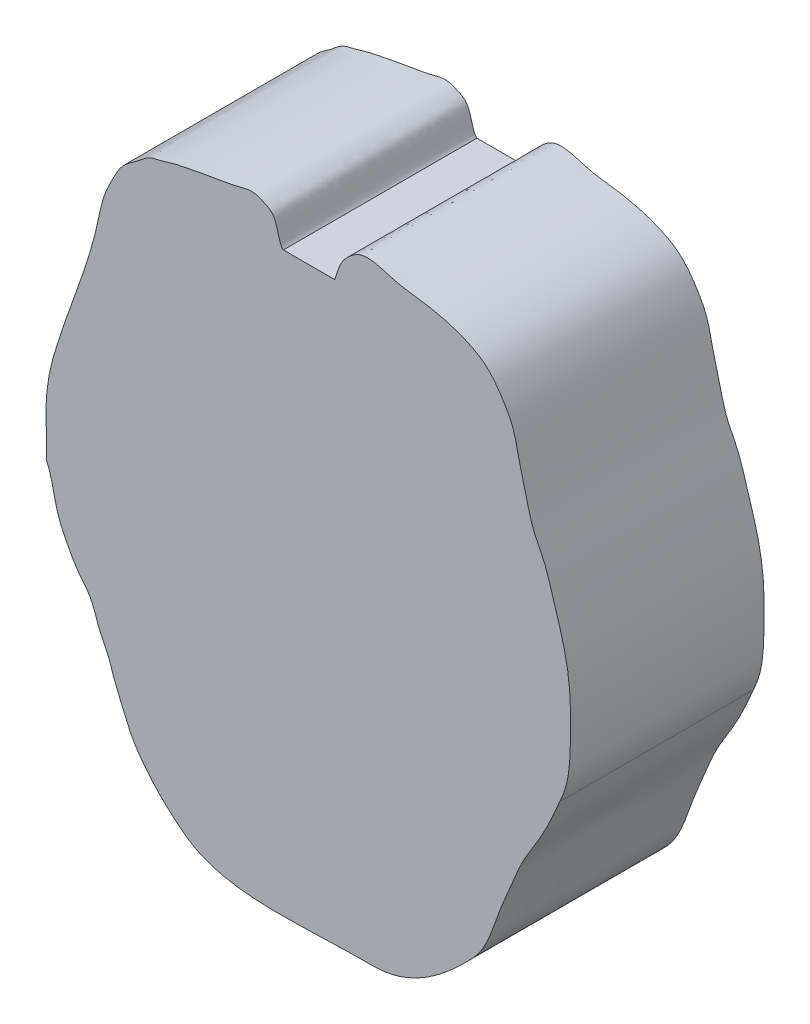
ISO-10303-21;
HEADER;
FILE_DESCRIPTION(('STEP AP214'),'2;1');
FILE_NAME('part.step','',(''),(''),'','','');
FILE_SCHEMA(('AUTOMOTIVE_DESIGN { 1 0 10303 214 1 1 1 1 }'));
ENDSEC;
DATA;
#1=APPLICATION_CONTEXT('core data for automotive mechanical design processes');
#2=APPLICATION_PROTOCOL_DEFINITION('international standard','automotive_design',2000,#1);
#3=PRODUCT_CONTEXT('',#1,'mechanical');
#4=PRODUCT('Part','Part','',(#3));
#5=PRODUCT_RELATED_PRODUCT_CATEGORY('part','',(#4));
#6=PRODUCT_DEFINITION_FORMATION('','',#4);
#7=PRODUCT_DEFINITION_CONTEXT('part definition',#1,'design');
#8=PRODUCT_DEFINITION('design','',#6,#7);
#9=PRODUCT_DEFINITION_SHAPE('','',#8);
#10=(LENGTH_UNIT() NAMED_UNIT(*) SI_UNIT(.MILLI.,.METRE.));
#11=(NAMED_UNIT(*) PLANE_ANGLE_UNIT() SI_UNIT($,.RADIAN.));
#12=(NAMED_UNIT(*) SI_UNIT($,.STERADIAN.) SOLID_ANGLE_UNIT());
#13=UNCERTAINTY_MEASURE_WITH_UNIT(LENGTH_MEASURE(1.E-05),#10,'distance_accuracy_value','');
#14=(GEOMETRIC_REPRESENTATION_CONTEXT(3) GLOBAL_UNCERTAINTY_ASSIGNED_CONTEXT((#13)) GLOBAL_UNIT_ASSIGNED_CONTEXT((#10,
#11,#12)) REPRESENTATION_CONTEXT('',''));
#15=CARTESIAN_POINT('',(0.,0.,0.));
#16=DIRECTION('',(0.,0.,1.));
#17=DIRECTION('',(1.,0.,0.));
#18=AXIS2_PLACEMENT_3D('',#15,#16,#17);
#19=CARTESIAN_POINT('',(6.72674796262277,70.641339760184,39.9268166449645));
#20=DIRECTION('',(0.,-1.,0.));
#21=DIRECTION('',(0.,0.,-1.));
#22=AXIS2_PLACEMENT_3D('',#19,#20,#21);
#23=PLANE('',#22);
#24=CARTESIAN_POINT('',(6.72674796262277,70.641339760184,0.));
#25=CARTESIAN_POINT('',(-3.87263552604294,70.641339760184,0.));
#26=B_SPLINE_CURVE_WITH_KNOTS('',1,(#24,#25),.UNSPECIFIED.,.F.,.F.,(2,2),(0.,1.),.UNSPECIFIED.);
#27=CARTESIAN_POINT('',(6.72674796262277,70.641339760184,0.));
#28=VERTEX_POINT('',#27);
#29=CARTESIAN_POINT('',(-3.87263552604294,70.641339760184,0.));
#30=VERTEX_POINT('',#29);
#31=EDGE_CURVE('E193',#28,#30,#26,.T.);
#32=ORIENTED_EDGE('',*,*,#31,.T.);
#33=DIRECTION('',(0.,0.,-1.));
#34=VECTOR('',#33,1.);
#35=CARTESIAN_POINT('',(-3.87263552604294,70.641339760184,39.9268166449645));
#36=LINE('',#35,#34);
#37=CARTESIAN_POINT('',(-3.87263552604294,70.641339760184,39.9268166449645));
#38=VERTEX_POINT('',#37);
#39=EDGE_CURVE('E11',#38,#30,#36,.T.);
#40=ORIENTED_EDGE('',*,*,#39,.F.);
#41=CARTESIAN_POINT('',(6.72674796262277,70.641339760184,39.9268166449645));
#42=CARTESIAN_POINT('',(-3.87263552604294,70.641339760184,39.9268166449645));
#43=B_SPLINE_CURVE_WITH_KNOTS('',1,(#41,#42),.UNSPECIFIED.,.F.,.F.,(2,2),(0.,1.),.UNSPECIFIED.);
#44=CARTESIAN_POINT('',(6.72674796262277,70.641339760184,39.9268166449645));
#45=VERTEX_POINT('',#44);
#46=EDGE_CURVE('E170',#45,#38,#43,.T.);
#47=ORIENTED_EDGE('',*,*,#46,.F.);
#48=DIRECTION('',(0.,0.,-1.));
#49=VECTOR('',#48,1.);
#50=CARTESIAN_POINT('',(6.72674796262277,70.641339760184,39.9268166449645));
#51=LINE('',#50,#49);
#52=EDGE_CURVE('E122',#45,#28,#51,.T.);
#53=ORIENTED_EDGE('',*,*,#52,.T.);
#54=EDGE_LOOP('',(#32,#40,#47,#53));
#55=FACE_BOUND('',#54,.T.);
#56=ADVANCED_FACE('F36',(#55),#23,.F.);
#57=CARTESIAN_POINT('',(-3.87263552604294,70.641339760184,39.9268166449645));
#58=CARTESIAN_POINT('',(-5.09944013174748,71.7202582335475,39.9268166449645));
#59=CARTESIAN_POINT('',(-4.8391645012602,75.6991577322834,39.9268166449645));
#60=CARTESIAN_POINT('',(-7.87878213783911,77.1347364284955,39.9268166449645));
#61=CARTESIAN_POINT('',(-9.47084895305679,77.8670577057418,39.9268166449645));
#62=CARTESIAN_POINT('',(-11.4452976249097,77.8144196798321,39.9268166449645));
#63=CARTESIAN_POINT('',(-13.5078827629788,77.1487603992426,39.9268166449645));
#64=CARTESIAN_POINT('',(-15.9803315749228,76.7605352808646,39.9268166449645));
#65=CARTESIAN_POINT('',(-18.6691196158922,76.2603937797415,39.9268166449645));
#66=CARTESIAN_POINT('',(-21.3352211577586,75.8237386927429,39.9268166449645));
#67=CARTESIAN_POINT('',(-24.149306579347,75.2221812203888,39.9268166449645));
#68=CARTESIAN_POINT('',(-26.661349391268,74.7820095672842,39.9268166449645));
#69=CARTESIAN_POINT('',(-29.0819249946789,73.8707714908555,39.9268166449645));
#70=CARTESIAN_POINT('',(-31.6663585343292,73.5617510529868,39.9268166449645));
#71=CARTESIAN_POINT('',(-33.9722235392609,71.2892773254946,39.9268166449645));
#72=CARTESIAN_POINT('',(-37.0148975065258,69.5576384801271,39.9268166449645));
#73=CARTESIAN_POINT('',(-39.1304080875687,65.759515520526,39.9268166449645));
#74=CARTESIAN_POINT('',(-41.2080549192268,61.5479524877048,39.9268166449645));
#75=CARTESIAN_POINT('',(-43.3269524566974,49.3288113552713,39.9268166449645));
#76=CARTESIAN_POINT('',(-47.62014341395,39.6563976296241,39.9268166449645));
#77=CARTESIAN_POINT('',(-50.2720091525815,31.2148099085499,39.9268166449645));
#78=B_SPLINE_CURVE_WITH_KNOTS('',3,(#57,#58,#59,#60,#61,#62,#63,#64,#65,#66,#67,#68,#69,#70,#71,
#72,#73,#74,#75,#76,#77),.UNSPECIFIED.,.F.,.F.,(4,1,1,1,1,1,1,1,1,1,1,1,1,1,1,1,1,1,4),(0.,
0.0774511265590292,0.0982020040132911,0.123194437276303,0.143123415569983,0.170918111330584,
0.20497811919955,0.237509029996539,0.274369119849238,0.307032128522416,0.346404150243918,
0.370266332496988,0.404974599356961,0.44113398183362,0.4888264911591,0.535018961012619,
0.60128812689905,0.666373303021425,1.),.UNSPECIFIED.);
#79=DIRECTION('',(0.,0.,-1.));
#80=VECTOR('',#79,1.);
#81=SURFACE_OF_LINEAR_EXTRUSION('',#78,#80);
#82=CARTESIAN_POINT('',(-3.87263552604294,70.641339760184,0.));
#83=CARTESIAN_POINT('',(-5.09944013174748,71.7202582335475,0.));
#84=CARTESIAN_POINT('',(-4.8391645012602,75.6991577322834,0.));
#85=CARTESIAN_POINT('',(-7.87878213783911,77.1347364284955,0.));
#86=CARTESIAN_POINT('',(-9.47084895305679,77.8670577057418,0.));
#87=CARTESIAN_POINT('',(-11.4452976249097,77.8144196798321,0.));
#88=CARTESIAN_POINT('',(-13.5078827629788,77.1487603992426,0.));
#89=CARTESIAN_POINT('',(-15.9803315749228,76.7605352808646,0.));
#90=CARTESIAN_POINT('',(-18.6691196158922,76.2603937797415,0.));
#91=CARTESIAN_POINT('',(-21.3352211577586,75.8237386927429,0.));
#92=CARTESIAN_POINT('',(-24.149306579347,75.2221812203888,0.));
#93=CARTESIAN_POINT('',(-26.661349391268,74.7820095672842,0.));
#94=CARTESIAN_POINT('',(-29.0819249946789,73.8707714908555,0.));
#95=CARTESIAN_POINT('',(-31.6663585343292,73.5617510529868,0.));
#96=CARTESIAN_POINT('',(-33.9722235392609,71.2892773254946,0.));
#97=CARTESIAN_POINT('',(-37.0148975065258,69.5576384801271,0.));
#98=CARTESIAN_POINT('',(-39.1304080875687,65.759515520526,0.));
#99=CARTESIAN_POINT('',(-41.2080549192268,61.5479524877048,0.));
#100=CARTESIAN_POINT('',(-43.3269524566974,49.3288113552713,0.));
#101=CARTESIAN_POINT('',(-47.62014341395,39.6563976296241,0.));
#102=CARTESIAN_POINT('',(-50.2720091525815,31.2148099085499,0.));
#103=B_SPLINE_CURVE_WITH_KNOTS('',3,(#82,#83,#84,#85,#86,#87,#88,#89,#90,#91,#92,#93,#94,#95,
#96,#97,#98,#99,#100,#101,#102),.UNSPECIFIED.,.F.,.F.,(4,1,1,1,1,1,1,1,1,1,1,1,1,1,1,1,1,1,4),
(0.,0.0774511265590292,0.0982020040132911,0.123194437276303,0.143123415569983,0.170918111330584,
0.20497811919955,0.237509029996539,0.274369119849238,0.307032128522416,0.346404150243918,
0.370266332496988,0.404974599356961,0.44113398183362,0.4888264911591,0.535018961012619,
0.60128812689905,0.666373303021425,1.),.UNSPECIFIED.);
#104=CARTESIAN_POINT('',(-50.2720091525815,31.2148099085499,0.));
#105=VERTEX_POINT('',#104);
#106=EDGE_CURVE('E184',#30,#105,#103,.T.);
#107=ORIENTED_EDGE('',*,*,#106,.T.);
#108=DIRECTION('',(0.,0.,-1.));
#109=VECTOR('',#108,1.);
#110=CARTESIAN_POINT('',(-50.2720091525815,31.2148099085499,39.9268166449645));
#111=LINE('',#110,#109);
#112=CARTESIAN_POINT('',(-50.2720091525815,31.2148099085499,39.9268166449645));
#113=VERTEX_POINT('',#112);
#114=EDGE_CURVE('E44',#113,#105,#111,.T.);
#115=ORIENTED_EDGE('',*,*,#114,.F.);
#116=EDGE_CURVE('E92',#38,#113,#78,.T.);
#117=ORIENTED_EDGE('',*,*,#116,.F.);
#118=ORIENTED_EDGE('',*,*,#39,.T.);
#119=EDGE_LOOP('',(#107,#115,#117,#118));
#120=FACE_BOUND('',#119,.T.);
#121=ADVANCED_FACE('F176',(#120),#81,.F.);
#122=CARTESIAN_POINT('',(-50.2720091525815,31.2148099085499,39.9268166449645));
#123=CARTESIAN_POINT('',(-51.5763422772298,27.3932307870519,39.9268166449645));
#124=CARTESIAN_POINT('',(-53.4233428912386,19.9068336489793,39.9268166449645));
#125=CARTESIAN_POINT('',(-52.5875733557582,12.3046540251995,39.9268166449645));
#126=CARTESIAN_POINT('',(-52.7861792261766,8.80812641619491,39.9268166449645));
#127=B_SPLINE_CURVE_WITH_KNOTS('',3,(#122,#123,#124,#125,#126),.UNSPECIFIED.,.F.,.F.,(4,1,4),
(0.,0.536736953329797,1.),.UNSPECIFIED.);
#128=DIRECTION('',(0.,0.,-1.));
#129=VECTOR('',#128,1.);
#130=SURFACE_OF_LINEAR_EXTRUSION('',#127,#129);
#131=CARTESIAN_POINT('',(-50.2720091525815,31.2148099085499,0.));
#132=CARTESIAN_POINT('',(-51.5763422772298,27.3932307870519,0.));
#133=CARTESIAN_POINT('',(-53.4233428912386,19.9068336489793,0.));
#134=CARTESIAN_POINT('',(-52.5875733557582,12.3046540251995,0.));
#135=CARTESIAN_POINT('',(-52.7861792261766,8.80812641619491,0.));
#136=B_SPLINE_CURVE_WITH_KNOTS('',3,(#131,#132,#133,#134,#135),.UNSPECIFIED.,.F.,.F.,(4,1,4),
(0.,0.536736953329797,1.),.UNSPECIFIED.);
#137=CARTESIAN_POINT('',(-52.7861792261766,8.80812641619491,0.));
#138=VERTEX_POINT('',#137);
#139=EDGE_CURVE('E192',#105,#138,#136,.T.);
#140=ORIENTED_EDGE('',*,*,#139,.T.);
#141=DIRECTION('',(0.,0.,-1.));
#142=VECTOR('',#141,1.);
#143=CARTESIAN_POINT('',(-52.7861792261766,8.80812641619491,39.9268166449645));
#144=LINE('',#143,#142);
#145=CARTESIAN_POINT('',(-52.7861792261766,8.80812641619491,39.9268166449645));
#146=VERTEX_POINT('',#145);
#147=EDGE_CURVE('E197',#146,#138,#144,.T.);
#148=ORIENTED_EDGE('',*,*,#147,.F.);
#149=EDGE_CURVE('E155',#113,#146,#127,.T.);
#150=ORIENTED_EDGE('',*,*,#149,.F.);
#151=ORIENTED_EDGE('',*,*,#114,.T.);
#152=EDGE_LOOP('',(#140,#148,#150,#151));
#153=FACE_BOUND('',#152,.T.);
#154=ADVANCED_FACE('F149',(#153),#130,.F.);
#155=CARTESIAN_POINT('',(-52.7861792261766,8.80812641619491,39.9268166449645));
#156=CARTESIAN_POINT('',(-51.4865977191283,5.9961133371352,39.9268166449645));
#157=CARTESIAN_POINT('',(-51.1363292863908,1.16422141057562,39.9268166449645));
#158=CARTESIAN_POINT('',(-48.4418175728673,-4.23458441890672,39.9268166449645));
#159=CARTESIAN_POINT('',(-46.2897119246832,-8.18480071899676,39.9268166449645));
#160=CARTESIAN_POINT('',(-43.5029832785752,-10.9590209191812,39.9268166449645));
#161=CARTESIAN_POINT('',(-41.733594112655,-16.6364645360096,39.9268166449645));
#162=CARTESIAN_POINT('',(-41.9507270533705,-15.7973502986241,39.9268166449645));
#163=CARTESIAN_POINT('',(-39.9034124539514,-20.1028890960595,39.9268166449645));
#164=B_SPLINE_CURVE_WITH_KNOTS('',3,(#155,#156,#157,#158,#159,#160,#161,#162,#163),
.UNSPECIFIED.,.F.,.F.,(4,1,1,1,1,1,4),(0.,0.289905529763368,0.441015591769616,0.567124192582072,
0.705030422219852,0.830943547768982,1.),.UNSPECIFIED.);
#165=DIRECTION('',(0.,0.,-1.));
#166=VECTOR('',#165,1.);
#167=SURFACE_OF_LINEAR_EXTRUSION('',#164,#166);
#168=CARTESIAN_POINT('',(-52.7861792261766,8.80812641619491,0.));
#169=CARTESIAN_POINT('',(-51.4865977191283,5.9961133371352,0.));
#170=CARTESIAN_POINT('',(-51.1363292863908,1.16422141057562,0.));
#171=CARTESIAN_POINT('',(-48.4418175728673,-4.23458441890672,0.));
#172=CARTESIAN_POINT('',(-46.2897119246832,-8.18480071899676,0.));
#173=CARTESIAN_POINT('',(-43.5029832785752,-10.9590209191812,0.));
#174=CARTESIAN_POINT('',(-41.733594112655,-16.6364645360096,0.));
#175=CARTESIAN_POINT('',(-41.9507270533705,-15.7973502986241,0.));
#176=CARTESIAN_POINT('',(-39.9034124539514,-20.1028890960595,0.));
#177=B_SPLINE_CURVE_WITH_KNOTS('',3,(#168,#169,#170,#171,#172,#173,#174,#175,#176),
.UNSPECIFIED.,.F.,.F.,(4,1,1,1,1,1,4),(0.,0.289905529763368,0.441015591769616,0.567124192582072,
0.705030422219852,0.830943547768982,1.),.UNSPECIFIED.);
#178=CARTESIAN_POINT('',(-39.9034124539514,-20.1028890960595,0.));
#179=VERTEX_POINT('',#178);
#180=EDGE_CURVE('E200',#138,#179,#177,.T.);
#181=ORIENTED_EDGE('',*,*,#180,.T.);
#182=DIRECTION('',(0.,0.,-1.));
#183=VECTOR('',#182,1.);
#184=CARTESIAN_POINT('',(-39.9034124539514,-20.1028890960595,39.9268166449645));
#185=LINE('',#184,#183);
#186=CARTESIAN_POINT('',(-39.9034124539514,-20.1028890960595,39.9268166449645));
#187=VERTEX_POINT('',#186);
#188=EDGE_CURVE('E117',#187,#179,#185,.T.);
#189=ORIENTED_EDGE('',*,*,#188,.F.);
#190=EDGE_CURVE('E108',#146,#187,#164,.T.);
#191=ORIENTED_EDGE('',*,*,#190,.F.);
#192=ORIENTED_EDGE('',*,*,#147,.T.);
#193=EDGE_LOOP('',(#181,#189,#191,#192));
#194=FACE_BOUND('',#193,.T.);
#195=ADVANCED_FACE('F146',(#194),#167,.F.);
#196=CARTESIAN_POINT('',(-39.9034124539515,-20.1028890960593,39.9268166449645));
#197=CARTESIAN_POINT('',(-39.0998291556524,-22.9104169298894,39.9268166449645));
#198=CARTESIAN_POINT('',(-37.3442060578139,-26.9250580714331,39.9268166449645));
#199=CARTESIAN_POINT('',(-35.2237735228893,-32.003363894348,39.9268166449645));
#200=CARTESIAN_POINT('',(-33.1858212067055,-35.0112691852337,39.9268166449645));
#201=CARTESIAN_POINT('',(-30.4295574621468,-38.4946348106708,39.9268166449645));
#202=CARTESIAN_POINT('',(-26.8550213189226,-41.9158690350379,39.9268166449645));
#203=CARTESIAN_POINT('',(-22.3074948875386,-45.4830447818576,39.9268166449645));
#204=CARTESIAN_POINT('',(-16.9530110988268,-47.4294339779559,39.9268166449645));
#205=CARTESIAN_POINT('',(-8.01464693299461,-48.6813412335191,39.9268166449645));
#206=CARTESIAN_POINT('',(1.87109432689435,-48.2180111393805,39.9268166449645));
#207=CARTESIAN_POINT('',(11.212196278673,-48.0110144165786,39.9268166449645));
#208=CARTESIAN_POINT('',(17.900915079522,-48.0643041684941,39.9268166449645));
#209=CARTESIAN_POINT('',(26.5333796790699,-44.8844617482461,39.9268166449645));
#210=CARTESIAN_POINT('',(31.9368966027794,-39.7225221159024,39.9268166449645));
#211=CARTESIAN_POINT('',(35.4121876941389,-36.0981901094731,39.9268166449645));
#212=B_SPLINE_CURVE_WITH_KNOTS('',3,(#196,#197,#198,#199,#200,#201,#202,#203,#204,#205,#206,
#207,#208,#209,#210,#211),.UNSPECIFIED.,.F.,.F.,(4,1,1,1,1,1,1,1,1,1,1,1,1,4),(0.,
0.0934032550822364,0.141289000741847,0.176289094702898,0.209818558322268,0.284015881068497,
0.334991321928554,0.394353771340265,0.46445241004427,0.624297851181017,0.711020843592571,
0.765725627006861,0.837948314396401,1.),.UNSPECIFIED.);
#213=DIRECTION('',(0.,0.,-1.));
#214=VECTOR('',#213,1.);
#215=SURFACE_OF_LINEAR_EXTRUSION('',#212,#214);
#216=CARTESIAN_POINT('',(-39.9034124539515,-20.1028890960593,0.));
#217=CARTESIAN_POINT('',(-39.0998291556524,-22.9104169298894,0.));
#218=CARTESIAN_POINT('',(-37.3442060578139,-26.9250580714331,0.));
#219=CARTESIAN_POINT('',(-35.2237735228893,-32.003363894348,0.));
#220=CARTESIAN_POINT('',(-33.1858212067055,-35.0112691852337,0.));
#221=CARTESIAN_POINT('',(-30.4295574621468,-38.4946348106708,0.));
#222=CARTESIAN_POINT('',(-26.8550213189226,-41.9158690350379,0.));
#223=CARTESIAN_POINT('',(-22.3074948875386,-45.4830447818576,0.));
#224=CARTESIAN_POINT('',(-16.9530110988268,-47.4294339779559,0.));
#225=CARTESIAN_POINT('',(-8.01464693299461,-48.6813412335191,0.));
#226=CARTESIAN_POINT('',(1.87109432689435,-48.2180111393805,0.));
#227=CARTESIAN_POINT('',(11.212196278673,-48.0110144165786,0.));
#228=CARTESIAN_POINT('',(17.900915079522,-48.0643041684941,0.));
#229=CARTESIAN_POINT('',(26.5333796790699,-44.8844617482461,0.));
#230=CARTESIAN_POINT('',(31.9368966027794,-39.7225221159024,0.));
#231=CARTESIAN_POINT('',(35.4121876941389,-36.0981901094731,0.));
#232=B_SPLINE_CURVE_WITH_KNOTS('',3,(#216,#217,#218,#219,#220,#221,#222,#223,#224,#225,#226,
#227,#228,#229,#230,#231),.UNSPECIFIED.,.F.,.F.,(4,1,1,1,1,1,1,1,1,1,1,1,1,4),(0.,
0.0934032550822364,0.141289000741847,0.176289094702898,0.209818558322268,0.284015881068497,
0.334991321928554,0.394353771340265,0.46445241004427,0.624297851181017,0.711020843592571,
0.765725627006861,0.837948314396401,1.),.UNSPECIFIED.);
#233=CARTESIAN_POINT('',(35.4121876941389,-36.0981901094731,0.));
#234=VERTEX_POINT('',#233);
#235=EDGE_CURVE('E116',#179,#234,#232,.T.);
#236=ORIENTED_EDGE('',*,*,#235,.T.);
#237=DIRECTION('',(0.,0.,-1.));
#238=VECTOR('',#237,1.);
#239=CARTESIAN_POINT('',(35.4121876941389,-36.0981901094731,39.9268166449645));
#240=LINE('',#239,#238);
#241=CARTESIAN_POINT('',(35.4121876941389,-36.0981901094731,39.9268166449645));
#242=VERTEX_POINT('',#241);
#243=EDGE_CURVE('E113',#242,#234,#240,.T.);
#244=ORIENTED_EDGE('',*,*,#243,.F.);
#245=EDGE_CURVE('E102',#187,#242,#212,.T.);
#246=ORIENTED_EDGE('',*,*,#245,.F.);
#247=ORIENTED_EDGE('',*,*,#188,.T.);
#248=EDGE_LOOP('',(#236,#244,#246,#247));
#249=FACE_BOUND('',#248,.T.);
#250=ADVANCED_FACE('F114',(#249),#215,.F.);
#251=CARTESIAN_POINT('',(35.4121876941389,-36.0981901094731,39.9268166449645));
#252=CARTESIAN_POINT('',(38.1690914988455,-33.0761228335682,39.9268166449645));
#253=CARTESIAN_POINT('',(39.8238498013174,-26.9315043106738,39.9268166449645));
#254=CARTESIAN_POINT('',(43.0427830611868,-19.5827426456605,39.9268166449645));
#255=CARTESIAN_POINT('',(45.4511896779582,-13.5168832446893,39.9268166449645));
#256=CARTESIAN_POINT('',(49.6140543508931,-7.43634159655043,39.9268166449645));
#257=CARTESIAN_POINT('',(51.9050143659175,-2.34954970833097,39.9268166449645));
#258=CARTESIAN_POINT('',(53.1059664971144,0.539121339267715,39.9268166449645));
#259=B_SPLINE_CURVE_WITH_KNOTS('',3,(#251,#252,#253,#254,#255,#256,#257,#258),.UNSPECIFIED.,.F.,
.F.,(4,1,1,1,1,4),(0.,0.29143047063952,0.461022707010863,0.591081239960475,0.769748109807126,
1.),.UNSPECIFIED.);
#260=DIRECTION('',(0.,0.,-1.));
#261=VECTOR('',#260,1.);
#262=SURFACE_OF_LINEAR_EXTRUSION('',#259,#261);
#263=CARTESIAN_POINT('',(35.4121876941389,-36.0981901094731,0.));
#264=CARTESIAN_POINT('',(38.1690914988455,-33.0761228335682,0.));
#265=CARTESIAN_POINT('',(39.8238498013174,-26.9315043106738,0.));
#266=CARTESIAN_POINT('',(43.0427830611868,-19.5827426456605,0.));
#267=CARTESIAN_POINT('',(45.4511896779582,-13.5168832446893,0.));
#268=CARTESIAN_POINT('',(49.6140543508931,-7.43634159655043,0.));
#269=CARTESIAN_POINT('',(51.9050143659175,-2.34954970833097,0.));
#270=CARTESIAN_POINT('',(53.1059664971144,0.539121339267715,0.));
#271=B_SPLINE_CURVE_WITH_KNOTS('',3,(#263,#264,#265,#266,#267,#268,#269,#270),.UNSPECIFIED.,.F.,
.F.,(4,1,1,1,1,4),(0.,0.29143047063952,0.461022707010863,0.591081239960475,0.769748109807126,
1.),.UNSPECIFIED.);
#272=CARTESIAN_POINT('',(53.1059664971144,0.539121339267715,0.));
#273=VERTEX_POINT('',#272);
#274=EDGE_CURVE('E78',#234,#273,#271,.T.);
#275=ORIENTED_EDGE('',*,*,#274,.T.);
#276=DIRECTION('',(0.,0.,-1.));
#277=VECTOR('',#276,1.);
#278=CARTESIAN_POINT('',(53.1059664971144,0.539121339267715,39.9268166449645));
#279=LINE('',#278,#277);
#280=CARTESIAN_POINT('',(53.1059664971144,0.539121339267715,39.9268166449645));
#281=VERTEX_POINT('',#280);
#282=EDGE_CURVE('E118',#281,#273,#279,.T.);
#283=ORIENTED_EDGE('',*,*,#282,.F.);
#284=EDGE_CURVE('E106',#242,#281,#259,.T.);
#285=ORIENTED_EDGE('',*,*,#284,.F.);
#286=ORIENTED_EDGE('',*,*,#243,.T.);
#287=EDGE_LOOP('',(#275,#283,#285,#286));
#288=FACE_BOUND('',#287,.T.);
#289=ADVANCED_FACE('F120',(#288),#262,.F.);
#290=CARTESIAN_POINT('',(53.1059664971144,0.539121339267715,39.9268166449645));
#291=CARTESIAN_POINT('',(55.2852913333332,4.843146783831,39.9268166449645));
#292=CARTESIAN_POINT('',(55.3300398881401,11.9807710725099,39.9268166449645));
#293=CARTESIAN_POINT('',(55.3797901299483,21.6845381107091,39.9268166449645));
#294=CARTESIAN_POINT('',(54.1242805055026,28.9239693255598,39.9268166449645));
#295=CARTESIAN_POINT('',(51.8256335895225,35.7560464423616,39.9268166449645));
#296=CARTESIAN_POINT('',(50.2568879620993,41.7021116891916,39.9268166449645));
#297=CARTESIAN_POINT('',(47.6076950450311,46.1436055606771,39.9268166449645));
#298=CARTESIAN_POINT('',(46.2378796255596,51.59825324403,39.9268166449645));
#299=CARTESIAN_POINT('',(44.7339743523664,57.1240677424882,39.9268166449645));
#300=CARTESIAN_POINT('',(43.6549099546067,62.7751035364359,39.9268166449645));
#301=CARTESIAN_POINT('',(41.2413460198481,66.859225512868,39.9268166449645));
#302=CARTESIAN_POINT('',(38.5577585111624,70.8458213573055,39.9268166449645));
#303=CARTESIAN_POINT('',(32.492266838587,74.1983875093782,39.9268166449645));
#304=CARTESIAN_POINT('',(26.0349698787972,75.7255297142532,39.9268166449645));
#305=CARTESIAN_POINT('',(19.5724364517963,76.3112607696579,39.9268166449645));
#306=CARTESIAN_POINT('',(15.6898636530833,77.8176981309294,39.9268166449645));
#307=CARTESIAN_POINT('',(12.0788115012327,78.0604474950897,39.9268166449645));
#308=CARTESIAN_POINT('',(9.59513242724593,76.373722994232,39.9268166449645));
#309=CARTESIAN_POINT('',(7.61019991135257,73.9016294747262,39.9268166449645));
#310=CARTESIAN_POINT('',(7.1309325248885,71.7647326797069,39.9268166449645));
#311=CARTESIAN_POINT('',(6.72674796262277,70.641339760184,39.9268166449645));
#312=B_SPLINE_CURVE_WITH_KNOTS('',3,(#290,#291,#292,#293,#294,#295,#296,#297,#298,#299,#300,
#301,#302,#303,#304,#305,#306,#307,#308,#309,#310,#311),.UNSPECIFIED.,.F.,.F.,(4,1,1,1,1,1,1,1,
1,1,1,1,1,1,1,1,1,1,1,4),(0.,0.126323067897174,0.191996151400782,0.263884615690162,
0.324471485148337,0.388128138123126,0.429942228941529,0.463619002793819,0.540078514986558,
0.586652556766317,0.617890508525696,0.668487670725654,0.714681129064806,0.801865072318508,
0.847819984737833,0.889771867939103,0.91507668820077,0.94208041674301,0.96735357050927,1.),.UNSPECIFIED.);
#313=DIRECTION('',(0.,0.,-1.));
#314=VECTOR('',#313,1.);
#315=SURFACE_OF_LINEAR_EXTRUSION('',#312,#314);
#316=CARTESIAN_POINT('',(53.1059664971144,0.539121339267715,0.));
#317=CARTESIAN_POINT('',(55.2852913333332,4.843146783831,0.));
#318=CARTESIAN_POINT('',(55.3300398881401,11.9807710725099,0.));
#319=CARTESIAN_POINT('',(55.3797901299483,21.6845381107091,0.));
#320=CARTESIAN_POINT('',(54.1242805055026,28.9239693255598,0.));
#321=CARTESIAN_POINT('',(51.8256335895225,35.7560464423616,0.));
#322=CARTESIAN_POINT('',(50.2568879620993,41.7021116891916,0.));
#323=CARTESIAN_POINT('',(47.6076950450311,46.1436055606771,0.));
#324=CARTESIAN_POINT('',(46.2378796255596,51.59825324403,0.));
#325=CARTESIAN_POINT('',(44.7339743523664,57.1240677424882,0.));
#326=CARTESIAN_POINT('',(43.6549099546067,62.7751035364359,0.));
#327=CARTESIAN_POINT('',(41.2413460198481,66.859225512868,0.));
#328=CARTESIAN_POINT('',(38.5577585111624,70.8458213573055,0.));
#329=CARTESIAN_POINT('',(32.492266838587,74.1983875093782,0.));
#330=CARTESIAN_POINT('',(26.0349698787972,75.7255297142532,0.));
#331=CARTESIAN_POINT('',(19.5724364517963,76.3112607696579,0.));
#332=CARTESIAN_POINT('',(15.6898636530833,77.8176981309294,0.));
#333=CARTESIAN_POINT('',(12.0788115012327,78.0604474950897,0.));
#334=CARTESIAN_POINT('',(9.59513242724593,76.373722994232,0.));
#335=CARTESIAN_POINT('',(7.61019991135257,73.9016294747262,0.));
#336=CARTESIAN_POINT('',(7.1309325248885,71.7647326797069,0.));
#337=CARTESIAN_POINT('',(6.72674796262277,70.641339760184,0.));
#338=B_SPLINE_CURVE_WITH_KNOTS('',3,(#316,#317,#318,#319,#320,#321,#322,#323,#324,#325,#326,
#327,#328,#329,#330,#331,#332,#333,#334,#335,#336,#337),.UNSPECIFIED.,.F.,.F.,(4,1,1,1,1,1,1,1,
1,1,1,1,1,1,1,1,1,1,1,4),(0.,0.126323067897174,0.191996151400782,0.263884615690162,
0.324471485148337,0.388128138123126,0.429942228941529,0.463619002793819,0.540078514986558,
0.586652556766317,0.617890508525696,0.668487670725654,0.714681129064806,0.801865072318508,
0.847819984737833,0.889771867939103,0.91507668820077,0.94208041674301,0.96735357050927,1.),.UNSPECIFIED.);
#339=EDGE_CURVE('E84',#273,#28,#338,.T.);
#340=ORIENTED_EDGE('',*,*,#339,.T.);
#341=ORIENTED_EDGE('',*,*,#52,.F.);
#342=EDGE_CURVE('E52',#281,#45,#312,.T.);
#343=ORIENTED_EDGE('',*,*,#342,.F.);
#344=ORIENTED_EDGE('',*,*,#282,.T.);
#345=EDGE_LOOP('',(#340,#341,#343,#344));
#346=FACE_BOUND('',#345,.T.);
#347=ADVANCED_FACE('F142',(#346),#315,.F.);
#348=CARTESIAN_POINT('',(-37.3762009921871,68.6241274283257,39.9268166449645));
#349=DIRECTION('',(0.,0.,1.));
#350=DIRECTION('',(1.,0.,0.));
#351=AXIS2_PLACEMENT_3D('',#348,#349,#350);
#352=PLANE('',#351);
#353=ORIENTED_EDGE('',*,*,#46,.T.);
#354=ORIENTED_EDGE('',*,*,#116,.T.);
#355=ORIENTED_EDGE('',*,*,#149,.T.);
#356=ORIENTED_EDGE('',*,*,#190,.T.);
#357=ORIENTED_EDGE('',*,*,#245,.T.);
#358=ORIENTED_EDGE('',*,*,#284,.T.);
#359=ORIENTED_EDGE('',*,*,#342,.T.);
#360=EDGE_LOOP('',(#353,#354,#355,#356,#357,#358,#359));
#361=FACE_BOUND('',#360,.T.);
#362=ADVANCED_FACE('F104',(#361),#352,.T.);
#363=CARTESIAN_POINT('',(-37.3762009921871,68.6241274283257,0.));
#364=DIRECTION('',(0.,0.,1.));
#365=DIRECTION('',(1.,0.,0.));
#366=AXIS2_PLACEMENT_3D('',#363,#364,#365);
#367=PLANE('',#366);
#368=ORIENTED_EDGE('',*,*,#31,.F.);
#369=ORIENTED_EDGE('',*,*,#339,.F.);
#370=ORIENTED_EDGE('',*,*,#274,.F.);
#371=ORIENTED_EDGE('',*,*,#235,.F.);
#372=ORIENTED_EDGE('',*,*,#180,.F.);
#373=ORIENTED_EDGE('',*,*,#139,.F.);
#374=ORIENTED_EDGE('',*,*,#106,.F.);
#375=EDGE_LOOP('',(#368,#369,#370,#371,#372,#373,#374));
#376=FACE_BOUND('',#375,.T.);
#377=ADVANCED_FACE('F199',(#376),#367,.F.);
#378=CLOSED_SHELL('',(#56,#121,#154,#195,#250,#289,#347,#362,#377));
#379=MANIFOLD_SOLID_BREP('B2',#378);
#380=ADVANCED_BREP_SHAPE_REPRESENTATION('',(#18,#379),#14);
#381=SHAPE_DEFINITION_REPRESENTATION(#9,#380);
ENDSEC;
END-ISO-10303-21;
